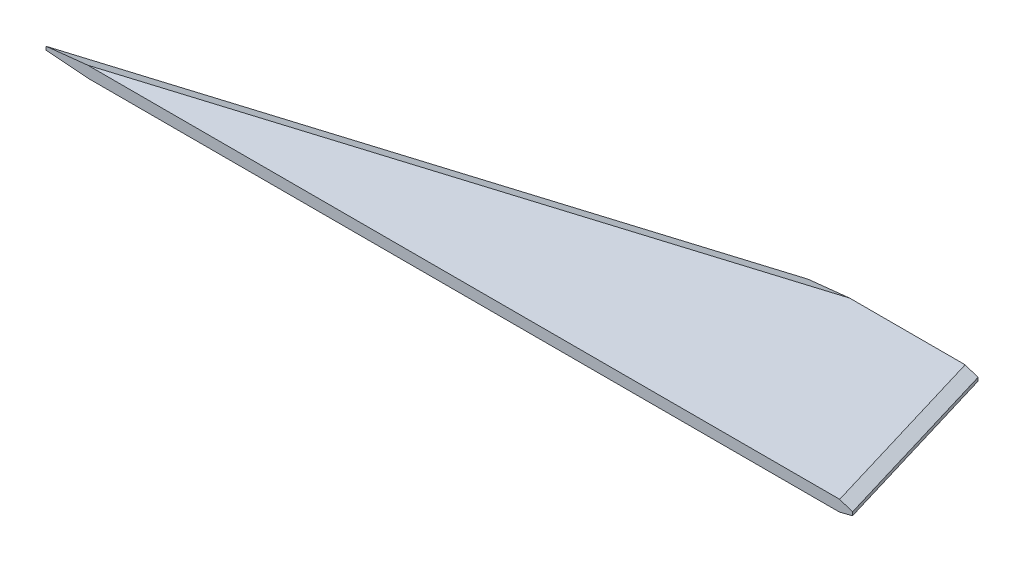
ISO-10303-21;
HEADER;
FILE_DESCRIPTION(('STEP AP214'),'2;1');
FILE_NAME('part.step','',(''),(''),'','','');
FILE_SCHEMA(('AUTOMOTIVE_DESIGN { 1 0 10303 214 1 1 1 1 }'));
ENDSEC;
DATA;
#1=APPLICATION_CONTEXT('core data for automotive mechanical design processes');
#2=APPLICATION_PROTOCOL_DEFINITION('international standard','automotive_design',2000,#1);
#3=PRODUCT_CONTEXT('',#1,'mechanical');
#4=PRODUCT('Part','Part','',(#3));
#5=PRODUCT_RELATED_PRODUCT_CATEGORY('part','',(#4));
#6=PRODUCT_DEFINITION_FORMATION('','',#4);
#7=PRODUCT_DEFINITION_CONTEXT('part definition',#1,'design');
#8=PRODUCT_DEFINITION('design','',#6,#7);
#9=PRODUCT_DEFINITION_SHAPE('','',#8);
#10=(LENGTH_UNIT() NAMED_UNIT(*) SI_UNIT(.MILLI.,.METRE.));
#11=(NAMED_UNIT(*) PLANE_ANGLE_UNIT() SI_UNIT($,.RADIAN.));
#12=(NAMED_UNIT(*) SI_UNIT($,.STERADIAN.) SOLID_ANGLE_UNIT());
#13=UNCERTAINTY_MEASURE_WITH_UNIT(LENGTH_MEASURE(1.E-05),#10,'distance_accuracy_value','');
#14=(GEOMETRIC_REPRESENTATION_CONTEXT(3) GLOBAL_UNCERTAINTY_ASSIGNED_CONTEXT((#13)) GLOBAL_UNIT_ASSIGNED_CONTEXT((#10,
#11,#12)) REPRESENTATION_CONTEXT('',''));
#15=CARTESIAN_POINT('',(0.,0.,0.));
#16=DIRECTION('',(0.,0.,1.));
#17=DIRECTION('',(1.,0.,0.));
#18=AXIS2_PLACEMENT_3D('',#15,#16,#17);
#19=CARTESIAN_POINT('',(0.,3.175,0.));
#20=DIRECTION('',(0.294085848837523,0.,0.95577900872195));
#21=DIRECTION('',(0.95577900872195,0.,-0.294085848837523));
#22=AXIS2_PLACEMENT_3D('',#19,#20,#21);
#23=PLANE('',#22);
#24=DIRECTION('',(0.,-1.,0.));
#25=VECTOR('',#24,1.);
#26=CARTESIAN_POINT('',(165.1,3.175,-50.8));
#27=LINE('',#26,#25);
#28=CARTESIAN_POINT('',(165.1,1.905,-50.8));
#29=VERTEX_POINT('',#28);
#30=CARTESIAN_POINT('',(165.1,0.952827328285069,-50.8));
#31=VERTEX_POINT('',#30);
#32=EDGE_CURVE('E136',#29,#31,#27,.T.);
#33=ORIENTED_EDGE('',*,*,#32,.T.);
#34=DIRECTION('',(-0.95577900872195,0.,0.294085848837523));
#35=VECTOR('',#34,1.);
#36=CARTESIAN_POINT('',(0.,0.952827328285069,0.));
#37=LINE('',#36,#35);
#38=CARTESIAN_POINT('',(0.,0.952827328285069,0.));
#39=VERTEX_POINT('',#38);
#40=EDGE_CURVE('E11',#31,#39,#37,.T.);
#41=ORIENTED_EDGE('',*,*,#40,.T.);
#42=DIRECTION('',(0.,-1.,0.));
#43=VECTOR('',#42,1.);
#44=CARTESIAN_POINT('',(0.,3.175,0.));
#45=LINE('',#44,#43);
#46=CARTESIAN_POINT('',(0.,1.905,0.));
#47=VERTEX_POINT('',#46);
#48=EDGE_CURVE('E129',#47,#39,#45,.T.);
#49=ORIENTED_EDGE('',*,*,#48,.F.);
#50=DIRECTION('',(0.95577900872195,0.,-0.294085848837523));
#51=VECTOR('',#50,1.);
#52=CARTESIAN_POINT('',(0.,1.905,0.));
#53=LINE('',#52,#51);
#54=EDGE_CURVE('E111',#47,#29,#53,.T.);
#55=ORIENTED_EDGE('',*,*,#54,.T.);
#56=EDGE_LOOP('',(#33,#41,#49,#55));
#57=FACE_BOUND('',#56,.T.);
#58=ADVANCED_FACE('F38',(#57),#23,.F.);
#59=CARTESIAN_POINT('',(0.,3.175,0.));
#60=DIRECTION('',(0.,0.,-1.));
#61=DIRECTION('',(-1.,0.,0.));
#62=AXIS2_PLACEMENT_3D('',#59,#60,#61);
#63=PLANE('',#62);
#64=DIRECTION('',(1.,0.,0.));
#65=VECTOR('',#64,1.);
#66=CARTESIAN_POINT('',(0.,0.,0.));
#67=LINE('',#66,#65);
#68=CARTESIAN_POINT('',(12.0917072822659,0.,0.));
#69=VERTEX_POINT('',#68);
#70=CARTESIAN_POINT('',(224.887427005431,0.,0.));
#71=VERTEX_POINT('',#70);
#72=EDGE_CURVE('E139',#69,#71,#67,.T.);
#73=ORIENTED_EDGE('',*,*,#72,.T.);
#74=DIRECTION('',(0.968608256430254,0.248592126937167,0.));
#75=VECTOR('',#74,1.);
#76=CARTESIAN_POINT('',(214.301802214565,-2.71678768403077,0.));
#77=LINE('',#76,#75);
#78=CARTESIAN_POINT('',(228.6,0.952827328285069,0.));
#79=VERTEX_POINT('',#78);
#80=EDGE_CURVE('E47',#71,#79,#77,.T.);
#81=ORIENTED_EDGE('',*,*,#80,.T.);
#82=DIRECTION('',(0.,-1.,0.));
#83=VECTOR('',#82,1.);
#84=CARTESIAN_POINT('',(228.6,3.175,0.));
#85=LINE('',#84,#83);
#86=CARTESIAN_POINT('',(228.6,1.90499999999998,0.));
#87=VERTEX_POINT('',#86);
#88=EDGE_CURVE('E148',#87,#79,#85,.T.);
#89=ORIENTED_EDGE('',*,*,#88,.F.);
#90=DIRECTION('',(0.944263873805493,-0.329189514756841,0.));
#91=VECTOR('',#90,1.);
#92=CARTESIAN_POINT('',(208.395463431642,8.94871073947761,0.));
#93=LINE('',#92,#91);
#94=CARTESIAN_POINT('',(224.957067689052,3.175,0.));
#95=VERTEX_POINT('',#94);
#96=EDGE_CURVE('E116',#87,#95,#93,.F.);
#97=ORIENTED_EDGE('',*,*,#96,.T.);
#98=DIRECTION('',(1.,0.,0.));
#99=VECTOR('',#98,1.);
#100=CARTESIAN_POINT('',(0.,3.175,0.));
#101=LINE('',#100,#99);
#102=CARTESIAN_POINT('',(11.8648902573858,3.175,0.));
#103=VERTEX_POINT('',#102);
#104=EDGE_CURVE('E124',#103,#95,#101,.T.);
#105=ORIENTED_EDGE('',*,*,#104,.F.);
#106=DIRECTION('',(0.994320140560691,0.106430531687893,0.));
#107=VECTOR('',#106,1.);
#108=CARTESIAN_POINT('',(1.14892801650977,2.02797952609036,0.));
#109=LINE('',#108,#107);
#110=EDGE_CURVE('E106',#103,#47,#109,.F.);
#111=ORIENTED_EDGE('',*,*,#110,.T.);
#112=ORIENTED_EDGE('',*,*,#48,.T.);
#113=DIRECTION('',(0.996909659386028,-0.0785565466580138,0.));
#114=VECTOR('',#113,1.);
#115=CARTESIAN_POINT('',(0.,0.952827328285069,0.));
#116=LINE('',#115,#114);
#117=EDGE_CURVE('E54',#39,#69,#116,.T.);
#118=ORIENTED_EDGE('',*,*,#117,.T.);
#119=EDGE_LOOP('',(#73,#81,#89,#97,#105,#111,#112,#118));
#120=FACE_BOUND('',#119,.T.);
#121=ADVANCED_FACE('F131',(#120),#63,.F.);
#122=CARTESIAN_POINT('',(213.36,3.175,-50.8));
#123=DIRECTION('',(-0.957826285221151,0.,0.287347885566346));
#124=DIRECTION('',(0.287347885566346,0.,0.957826285221151));
#125=AXIS2_PLACEMENT_3D('',#122,#123,#124);
#126=PLANE('',#125);
#127=ORIENTED_EDGE('',*,*,#88,.T.);
#128=DIRECTION('',(-0.287347885566346,0.,-0.957826285221151));
#129=VECTOR('',#128,1.);
#130=CARTESIAN_POINT('',(213.36,0.952827328285069,-50.8));
#131=LINE('',#130,#129);
#132=CARTESIAN_POINT('',(213.36,0.952827328285069,-50.8));
#133=VERTEX_POINT('',#132);
#134=EDGE_CURVE('E160',#79,#133,#131,.T.);
#135=ORIENTED_EDGE('',*,*,#134,.T.);
#136=DIRECTION('',(0.,-1.,0.));
#137=VECTOR('',#136,1.);
#138=CARTESIAN_POINT('',(213.36,3.175,-50.8));
#139=LINE('',#138,#137);
#140=CARTESIAN_POINT('',(213.36,1.90499999999998,-50.8));
#141=VERTEX_POINT('',#140);
#142=EDGE_CURVE('E145',#141,#133,#139,.T.);
#143=ORIENTED_EDGE('',*,*,#142,.F.);
#144=DIRECTION('',(0.287347885566346,0.,0.957826285221151));
#145=VECTOR('',#144,1.);
#146=CARTESIAN_POINT('',(213.36,1.90499999999998,-50.8));
#147=LINE('',#146,#145);
#148=EDGE_CURVE('E117',#141,#87,#147,.T.);
#149=ORIENTED_EDGE('',*,*,#148,.T.);
#150=EDGE_LOOP('',(#127,#135,#143,#149));
#151=FACE_BOUND('',#150,.T.);
#152=ADVANCED_FACE('F174',(#151),#126,.F.);
#153=CARTESIAN_POINT('',(165.1,3.175,-50.8));
#154=DIRECTION('',(0.,0.,1.));
#155=DIRECTION('',(1.,0.,0.));
#156=AXIS2_PLACEMENT_3D('',#153,#154,#155);
#157=PLANE('',#156);
#158=ORIENTED_EDGE('',*,*,#142,.T.);
#159=DIRECTION('',(-0.968608256430254,-0.248592126937167,0.));
#160=VECTOR('',#159,1.);
#161=CARTESIAN_POINT('',(213.36,0.952827328285069,-50.8));
#162=LINE('',#161,#160);
#163=CARTESIAN_POINT('',(209.647427005431,0.,-50.8));
#164=VERTEX_POINT('',#163);
#165=EDGE_CURVE('E165',#133,#164,#162,.T.);
#166=ORIENTED_EDGE('',*,*,#165,.T.);
#167=DIRECTION('',(-1.,0.,0.));
#168=VECTOR('',#167,1.);
#169=CARTESIAN_POINT('',(165.1,0.,-50.8));
#170=LINE('',#169,#168);
#171=CARTESIAN_POINT('',(177.191707282266,0.,-50.8));
#172=VERTEX_POINT('',#171);
#173=EDGE_CURVE('E134',#164,#172,#170,.T.);
#174=ORIENTED_EDGE('',*,*,#173,.T.);
#175=DIRECTION('',(-0.996909659386028,0.0785565466580138,0.));
#176=VECTOR('',#175,1.);
#177=CARTESIAN_POINT('',(1.01885373186968,13.8824324345804,-50.8));
#178=LINE('',#177,#176);
#179=EDGE_CURVE('E163',#172,#31,#178,.T.);
#180=ORIENTED_EDGE('',*,*,#179,.T.);
#181=ORIENTED_EDGE('',*,*,#32,.F.);
#182=DIRECTION('',(-0.994320140560691,-0.106430531687893,0.));
#183=VECTOR('',#182,1.);
#184=CARTESIAN_POINT('',(3.01909134475296,-15.4438965786285,-50.8));
#185=LINE('',#184,#183);
#186=CARTESIAN_POINT('',(176.964890257386,3.175,-50.8));
#187=VERTEX_POINT('',#186);
#188=EDGE_CURVE('E153',#29,#187,#185,.F.);
#189=ORIENTED_EDGE('',*,*,#188,.T.);
#190=DIRECTION('',(-1.,0.,0.));
#191=VECTOR('',#190,1.);
#192=CARTESIAN_POINT('',(165.1,3.175,-50.8));
#193=LINE('',#192,#191);
#194=CARTESIAN_POINT('',(209.717067689052,3.175,-50.8));
#195=VERTEX_POINT('',#194);
#196=EDGE_CURVE('E127',#195,#187,#193,.T.);
#197=ORIENTED_EDGE('',*,*,#196,.F.);
#198=DIRECTION('',(-0.944263873805493,0.329189514756841,0.));
#199=VECTOR('',#198,1.);
#200=CARTESIAN_POINT('',(206.743969605465,4.21148221923002,-50.8));
#201=LINE('',#200,#199);
#202=EDGE_CURVE('E155',#195,#141,#201,.F.);
#203=ORIENTED_EDGE('',*,*,#202,.T.);
#204=EDGE_LOOP('',(#158,#166,#174,#180,#181,#189,#197,#203));
#205=FACE_BOUND('',#204,.T.);
#206=ADVANCED_FACE('F179',(#205),#157,.F.);
#207=CARTESIAN_POINT('',(0.,3.175,0.));
#208=DIRECTION('',(0.,-1.,0.));
#209=DIRECTION('',(0.,0.,-1.));
#210=AXIS2_PLACEMENT_3D('',#207,#208,#209);
#211=PLANE('',#210);
#212=ORIENTED_EDGE('',*,*,#104,.T.);
#213=DIRECTION('',(-0.287347885566346,0.,-0.957826285221151));
#214=VECTOR('',#213,1.);
#215=CARTESIAN_POINT('',(206.382630907387,3.175,-61.9147892722162));
#216=LINE('',#215,#214);
#217=EDGE_CURVE('E128',#95,#195,#216,.T.);
#218=ORIENTED_EDGE('',*,*,#217,.T.);
#219=ORIENTED_EDGE('',*,*,#196,.T.);
#220=DIRECTION('',(-0.95577900872195,0.,0.294085848837523));
#221=VECTOR('',#220,1.);
#222=CARTESIAN_POINT('',(1.02615267090904,3.175,3.33499618045438));
#223=LINE('',#222,#221);
#224=EDGE_CURVE('E110',#187,#103,#223,.T.);
#225=ORIENTED_EDGE('',*,*,#224,.T.);
#226=EDGE_LOOP('',(#212,#218,#219,#225));
#227=FACE_BOUND('',#226,.T.);
#228=ADVANCED_FACE('F122',(#227),#211,.F.);
#229=CARTESIAN_POINT('',(0.,0.,0.));
#230=DIRECTION('',(0.,-1.,0.));
#231=DIRECTION('',(0.,0.,-1.));
#232=AXIS2_PLACEMENT_3D('',#229,#230,#231);
#233=PLANE('',#232);
#234=ORIENTED_EDGE('',*,*,#173,.F.);
#235=DIRECTION('',(0.287347885566346,0.,0.957826285221151));
#236=VECTOR('',#235,1.);
#237=CARTESIAN_POINT('',(225.193969729754,0.,1.02180908107393));
#238=LINE('',#237,#236);
#239=EDGE_CURVE('E61',#164,#71,#238,.T.);
#240=ORIENTED_EDGE('',*,*,#239,.T.);
#241=ORIENTED_EDGE('',*,*,#72,.F.);
#242=DIRECTION('',(0.95577900872195,0.,-0.294085848837523));
#243=VECTOR('',#242,1.);
#244=CARTESIAN_POINT('',(166.145769278466,0.,-47.4012498449847));
#245=LINE('',#244,#243);
#246=EDGE_CURVE('E167',#69,#172,#245,.T.);
#247=ORIENTED_EDGE('',*,*,#246,.T.);
#248=EDGE_LOOP('',(#234,#240,#241,#247));
#249=FACE_BOUND('',#248,.T.);
#250=ADVANCED_FACE('F181',(#249),#233,.T.);
#251=CARTESIAN_POINT('',(206.382630907387,3.175,-61.9147892722163));
#252=DIRECTION('',(-0.32759588335243,-0.939692620785909,0.0982787650057291));
#253=DIRECTION('',(-0.287347885566346,0.,-0.957826285221151));
#254=AXIS2_PLACEMENT_3D('',#251,#252,#253);
#255=PLANE('',#254);
#256=ORIENTED_EDGE('',*,*,#96,.F.);
#257=ORIENTED_EDGE('',*,*,#148,.F.);
#258=ORIENTED_EDGE('',*,*,#202,.F.);
#259=ORIENTED_EDGE('',*,*,#217,.F.);
#260=EDGE_LOOP('',(#256,#257,#258,#259));
#261=FACE_BOUND('',#260,.T.);
#262=ADVANCED_FACE('F193',(#261),#255,.F.);
#263=CARTESIAN_POINT('',(1.02615267090904,3.175,3.33499618045438));
#264=DIRECTION('',(0.100583284169461,-0.939692620785909,0.326895673550747));
#265=DIRECTION('',(-0.95577900872195,0.,0.294085848837523));
#266=AXIS2_PLACEMENT_3D('',#263,#264,#265);
#267=PLANE('',#266);
#268=ORIENTED_EDGE('',*,*,#188,.F.);
#269=ORIENTED_EDGE('',*,*,#54,.F.);
#270=ORIENTED_EDGE('',*,*,#110,.F.);
#271=ORIENTED_EDGE('',*,*,#224,.F.);
#272=EDGE_LOOP('',(#268,#269,#270,#271));
#273=FACE_BOUND('',#272,.T.);
#274=ADVANCED_FACE('F109',(#273),#267,.F.);
#275=CARTESIAN_POINT('',(213.36,0.952827328285069,-50.8));
#276=DIRECTION('',(0.247903684515031,-0.965925826289069,-0.0743711053545095));
#277=DIRECTION('',(0.287347885566346,0.,0.957826285221151));
#278=AXIS2_PLACEMENT_3D('',#275,#276,#277);
#279=PLANE('',#278);
#280=ORIENTED_EDGE('',*,*,#80,.F.);
#281=ORIENTED_EDGE('',*,*,#239,.F.);
#282=ORIENTED_EDGE('',*,*,#165,.F.);
#283=ORIENTED_EDGE('',*,*,#134,.F.);
#284=EDGE_LOOP('',(#280,#281,#282,#283));
#285=FACE_BOUND('',#284,.T.);
#286=ADVANCED_FACE('F177',(#285),#279,.T.);
#287=CARTESIAN_POINT('',(0.,0.952827328285069,0.));
#288=DIRECTION('',(-0.0761150185742911,-0.965925826289069,-0.247373810366446));
#289=DIRECTION('',(0.95577900872195,0.,-0.294085848837523));
#290=AXIS2_PLACEMENT_3D('',#287,#288,#289);
#291=PLANE('',#290);
#292=ORIENTED_EDGE('',*,*,#179,.F.);
#293=ORIENTED_EDGE('',*,*,#246,.F.);
#294=ORIENTED_EDGE('',*,*,#117,.F.);
#295=ORIENTED_EDGE('',*,*,#40,.F.);
#296=EDGE_LOOP('',(#292,#293,#294,#295));
#297=FACE_BOUND('',#296,.T.);
#298=ADVANCED_FACE('F41',(#297),#291,.T.);
#299=CLOSED_SHELL('',(#58,#121,#152,#206,#228,#250,#262,#274,#286,#298));
#300=MANIFOLD_SOLID_BREP('B2',#299);
#301=ADVANCED_BREP_SHAPE_REPRESENTATION('',(#18,#300),#14);
#302=SHAPE_DEFINITION_REPRESENTATION(#9,#301);
ENDSEC;
END-ISO-10303-21;
